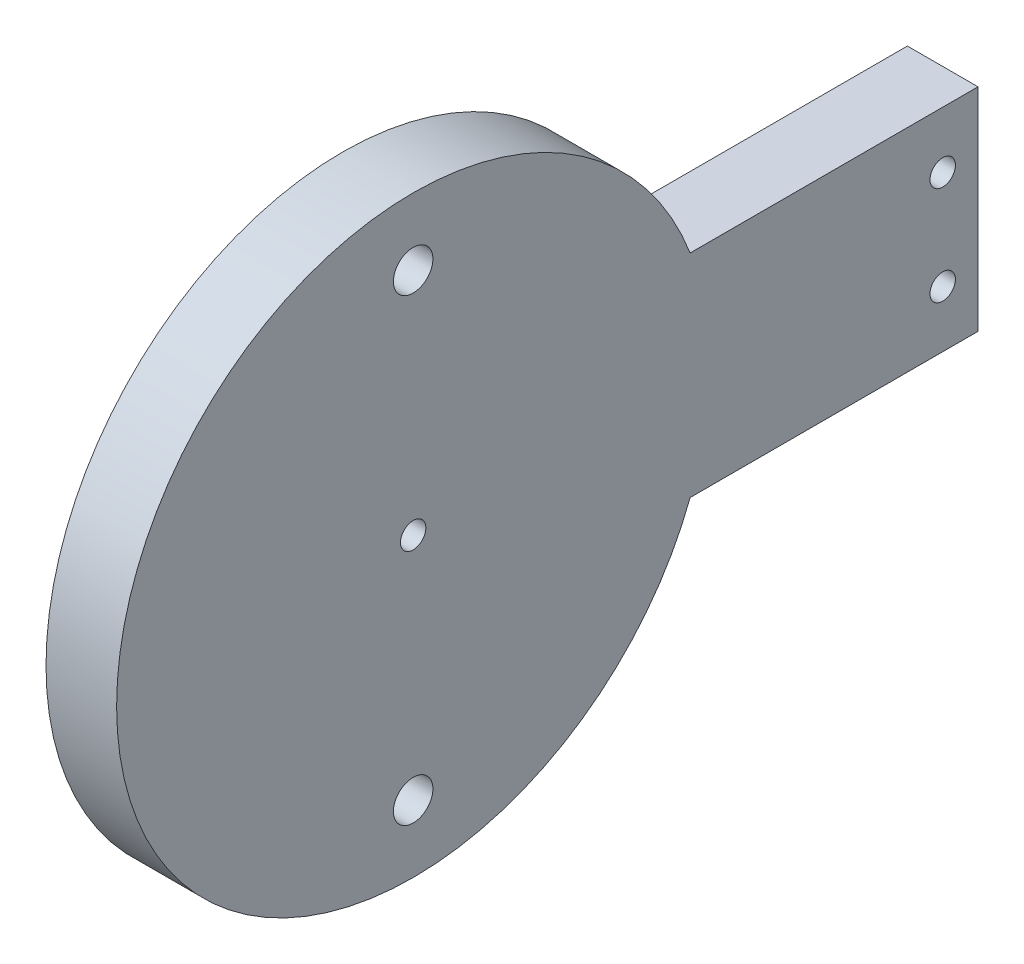
ISO-10303-21;
HEADER;
FILE_DESCRIPTION(('STEP AP214'),'2;1');
FILE_NAME('part.step','',(''),(''),'','','');
FILE_SCHEMA(('AUTOMOTIVE_DESIGN { 1 0 10303 214 1 1 1 1 }'));
ENDSEC;
DATA;
#1=APPLICATION_CONTEXT('core data for automotive mechanical design processes');
#2=APPLICATION_PROTOCOL_DEFINITION('international standard','automotive_design',2000,#1);
#3=PRODUCT_CONTEXT('',#1,'mechanical');
#4=PRODUCT('Part','Part','',(#3));
#5=PRODUCT_RELATED_PRODUCT_CATEGORY('part','',(#4));
#6=PRODUCT_DEFINITION_FORMATION('','',#4);
#7=PRODUCT_DEFINITION_CONTEXT('part definition',#1,'design');
#8=PRODUCT_DEFINITION('design','',#6,#7);
#9=PRODUCT_DEFINITION_SHAPE('','',#8);
#10=(LENGTH_UNIT() NAMED_UNIT(*) SI_UNIT(.MILLI.,.METRE.));
#11=(NAMED_UNIT(*) PLANE_ANGLE_UNIT() SI_UNIT($,.RADIAN.));
#12=(NAMED_UNIT(*) SI_UNIT($,.STERADIAN.) SOLID_ANGLE_UNIT());
#13=UNCERTAINTY_MEASURE_WITH_UNIT(LENGTH_MEASURE(1.E-05),#10,'distance_accuracy_value','');
#14=(GEOMETRIC_REPRESENTATION_CONTEXT(3) GLOBAL_UNCERTAINTY_ASSIGNED_CONTEXT((#13)) GLOBAL_UNIT_ASSIGNED_CONTEXT((#10,
#11,#12)) REPRESENTATION_CONTEXT('',''));
#15=CARTESIAN_POINT('',(0.,0.,0.));
#16=DIRECTION('',(0.,0.,1.));
#17=DIRECTION('',(1.,0.,0.));
#18=AXIS2_PLACEMENT_3D('',#15,#16,#17);
#19=CARTESIAN_POINT('',(-4.00000000000001,13.5,21.8771349286105));
#20=DIRECTION('',(-1.,0.,0.));
#21=DIRECTION('',(0.,0.,1.));
#22=AXIS2_PLACEMENT_3D('',#19,#20,#21);
#23=CYLINDRICAL_SURFACE('',#22,21.);
#24=CARTESIAN_POINT('',(-9.00000000000001,13.5,21.8771349286105));
#25=DIRECTION('',(-1.,0.,0.));
#26=DIRECTION('',(0.,0.,1.));
#27=AXIS2_PLACEMENT_3D('',#24,#25,#26);
#28=CIRCLE('',#27,21.);
#29=CARTESIAN_POINT('',(-9.00000000000001,5.99999999999999,2.26208968267751));
#30=VERTEX_POINT('',#29);
#31=CARTESIAN_POINT('',(-9.00000000000001,21.,2.26208968267751));
#32=VERTEX_POINT('',#31);
#33=EDGE_CURVE('E99',#30,#32,#28,.T.);
#34=ORIENTED_EDGE('',*,*,#33,.F.);
#35=DIRECTION('',(-1.,0.,0.));
#36=VECTOR('',#35,1.);
#37=CARTESIAN_POINT('',(-4.00000000000001,5.99999999999999,2.26208968267751));
#38=LINE('',#37,#36);
#39=CARTESIAN_POINT('',(-4.00000000000001,5.99999999999999,2.26208968267751));
#40=VERTEX_POINT('',#39);
#41=EDGE_CURVE('E11',#40,#30,#38,.T.);
#42=ORIENTED_EDGE('',*,*,#41,.F.);
#43=CARTESIAN_POINT('',(-4.00000000000001,13.5,21.8771349286105));
#44=DIRECTION('',(-1.,0.,0.));
#45=DIRECTION('',(0.,0.,1.));
#46=AXIS2_PLACEMENT_3D('',#43,#44,#45);
#47=CIRCLE('',#46,21.);
#48=CARTESIAN_POINT('',(-4.00000000000001,21.,2.26208968267751));
#49=VERTEX_POINT('',#48);
#50=EDGE_CURVE('E92',#40,#49,#47,.T.);
#51=ORIENTED_EDGE('',*,*,#50,.T.);
#52=DIRECTION('',(-1.,0.,0.));
#53=VECTOR('',#52,1.);
#54=CARTESIAN_POINT('',(-4.00000000000001,21.,2.26208968267751));
#55=LINE('',#54,#53);
#56=EDGE_CURVE('E37',#49,#32,#55,.T.);
#57=ORIENTED_EDGE('',*,*,#56,.T.);
#58=EDGE_LOOP('',(#34,#42,#51,#57));
#59=FACE_BOUND('',#58,.T.);
#60=ADVANCED_FACE('F34',(#59),#23,.T.);
#61=CARTESIAN_POINT('',(-4.00000000000001,5.99999999999999,-18.1228650713895));
#62=DIRECTION('',(0.,-1.,0.));
#63=DIRECTION('',(0.,0.,-1.));
#64=AXIS2_PLACEMENT_3D('',#61,#62,#63);
#65=PLANE('',#64);
#66=DIRECTION('',(0.,0.,1.));
#67=VECTOR('',#66,1.);
#68=CARTESIAN_POINT('',(-9.00000000000001,5.99999999999999,-18.1228650713895));
#69=LINE('',#68,#67);
#70=CARTESIAN_POINT('',(-9.00000000000001,5.99999999999999,-18.1228650713895));
#71=VERTEX_POINT('',#70);
#72=EDGE_CURVE('E94',#71,#30,#69,.T.);
#73=ORIENTED_EDGE('',*,*,#72,.F.);
#74=DIRECTION('',(-1.,0.,0.));
#75=VECTOR('',#74,1.);
#76=CARTESIAN_POINT('',(-4.00000000000001,5.99999999999999,-18.1228650713895));
#77=LINE('',#76,#75);
#78=CARTESIAN_POINT('',(-4.00000000000001,5.99999999999999,-18.1228650713895));
#79=VERTEX_POINT('',#78);
#80=EDGE_CURVE('E43',#79,#71,#77,.T.);
#81=ORIENTED_EDGE('',*,*,#80,.F.);
#82=DIRECTION('',(0.,0.,1.));
#83=VECTOR('',#82,1.);
#84=CARTESIAN_POINT('',(-4.00000000000001,5.99999999999999,-18.1228650713895));
#85=LINE('',#84,#83);
#86=EDGE_CURVE('E89',#79,#40,#85,.T.);
#87=ORIENTED_EDGE('',*,*,#86,.T.);
#88=ORIENTED_EDGE('',*,*,#41,.T.);
#89=EDGE_LOOP('',(#73,#81,#87,#88));
#90=FACE_BOUND('',#89,.T.);
#91=ADVANCED_FACE('F110',(#90),#65,.T.);
#92=CARTESIAN_POINT('',(-4.00000000000001,21.,-18.1228650713895));
#93=DIRECTION('',(0.,0.,-1.));
#94=DIRECTION('',(-1.,0.,0.));
#95=AXIS2_PLACEMENT_3D('',#92,#93,#94);
#96=PLANE('',#95);
#97=DIRECTION('',(0.,-1.,0.));
#98=VECTOR('',#97,1.);
#99=CARTESIAN_POINT('',(-9.00000000000001,21.,-18.1228650713895));
#100=LINE('',#99,#98);
#101=CARTESIAN_POINT('',(-9.00000000000001,21.,-18.1228650713895));
#102=VERTEX_POINT('',#101);
#103=EDGE_CURVE('E84',#102,#71,#100,.T.);
#104=ORIENTED_EDGE('',*,*,#103,.F.);
#105=DIRECTION('',(-1.,0.,0.));
#106=VECTOR('',#105,1.);
#107=CARTESIAN_POINT('',(-4.00000000000001,21.,-18.1228650713895));
#108=LINE('',#107,#106);
#109=CARTESIAN_POINT('',(-4.00000000000001,21.,-18.1228650713895));
#110=VERTEX_POINT('',#109);
#111=EDGE_CURVE('E79',#110,#102,#108,.T.);
#112=ORIENTED_EDGE('',*,*,#111,.F.);
#113=DIRECTION('',(0.,-1.,0.));
#114=VECTOR('',#113,1.);
#115=CARTESIAN_POINT('',(-4.00000000000001,21.,-18.1228650713895));
#116=LINE('',#115,#114);
#117=EDGE_CURVE('E82',#110,#79,#116,.T.);
#118=ORIENTED_EDGE('',*,*,#117,.T.);
#119=ORIENTED_EDGE('',*,*,#80,.T.);
#120=EDGE_LOOP('',(#104,#112,#118,#119));
#121=FACE_BOUND('',#120,.T.);
#122=ADVANCED_FACE('F81',(#121),#96,.T.);
#123=CARTESIAN_POINT('',(-4.00000000000001,21.,-18.1228650713895));
#124=DIRECTION('',(0.,1.,0.));
#125=DIRECTION('',(0.,0.,1.));
#126=AXIS2_PLACEMENT_3D('',#123,#124,#125);
#127=PLANE('',#126);
#128=DIRECTION('',(0.,0.,-1.));
#129=VECTOR('',#128,1.);
#130=CARTESIAN_POINT('',(-9.00000000000001,21.,-18.1228650713895));
#131=LINE('',#130,#129);
#132=EDGE_CURVE('E102',#32,#102,#131,.T.);
#133=ORIENTED_EDGE('',*,*,#132,.F.);
#134=ORIENTED_EDGE('',*,*,#56,.F.);
#135=DIRECTION('',(0.,0.,-1.));
#136=VECTOR('',#135,1.);
#137=CARTESIAN_POINT('',(-4.00000000000001,21.,-18.1228650713895));
#138=LINE('',#137,#136);
#139=EDGE_CURVE('E88',#49,#110,#138,.T.);
#140=ORIENTED_EDGE('',*,*,#139,.T.);
#141=ORIENTED_EDGE('',*,*,#111,.T.);
#142=EDGE_LOOP('',(#133,#134,#140,#141));
#143=FACE_BOUND('',#142,.T.);
#144=ADVANCED_FACE('F91',(#143),#127,.T.);
#145=CARTESIAN_POINT('',(-4.00000000000001,13.5,21.8771349286105));
#146=DIRECTION('',(-1.,0.,0.));
#147=DIRECTION('',(0.,0.,1.));
#148=AXIS2_PLACEMENT_3D('',#145,#146,#147);
#149=PLANE('',#148);
#150=CARTESIAN_POINT('',(-4.00000000000001,17.,-15.6228650713895));
#151=DIRECTION('',(-1.,0.,0.));
#152=DIRECTION('',(0.,0.,1.));
#153=AXIS2_PLACEMENT_3D('',#150,#151,#152);
#154=CIRCLE('',#153,0.900000000000004);
#155=CARTESIAN_POINT('',(-4.00000000000001,17.,-14.7228650713894));
#156=VERTEX_POINT('',#155);
#157=EDGE_CURVE('E158',#156,#156,#154,.T.);
#158=ORIENTED_EDGE('',*,*,#157,.T.);
#159=EDGE_LOOP('',(#158));
#160=FACE_BOUND('',#159,.T.);
#161=CARTESIAN_POINT('',(-4.00000000000001,9.99999999999999,-15.6228650713895));
#162=DIRECTION('',(-1.,0.,0.));
#163=DIRECTION('',(0.,0.,1.));
#164=AXIS2_PLACEMENT_3D('',#161,#162,#163);
#165=CIRCLE('',#164,0.9);
#166=CARTESIAN_POINT('',(-4.00000000000001,9.99999999999999,-14.7228650713895));
#167=VERTEX_POINT('',#166);
#168=EDGE_CURVE('E160',#167,#167,#165,.T.);
#169=ORIENTED_EDGE('',*,*,#168,.T.);
#170=EDGE_LOOP('',(#169));
#171=FACE_BOUND('',#170,.T.);
#172=CARTESIAN_POINT('',(-4.00000000000001,29.75,21.8771349286105));
#173=DIRECTION('',(-1.,0.,0.));
#174=DIRECTION('',(0.,0.,1.));
#175=AXIS2_PLACEMENT_3D('',#172,#173,#174);
#176=CIRCLE('',#175,1.4);
#177=CARTESIAN_POINT('',(-4.00000000000001,29.75,23.2771349286105));
#178=VERTEX_POINT('',#177);
#179=EDGE_CURVE('E165',#178,#178,#176,.T.);
#180=ORIENTED_EDGE('',*,*,#179,.T.);
#181=EDGE_LOOP('',(#180));
#182=FACE_BOUND('',#181,.T.);
#183=CARTESIAN_POINT('',(-4.00000000000001,-2.75000000000001,21.8771349286105));
#184=DIRECTION('',(-1.,0.,0.));
#185=DIRECTION('',(0.,0.,1.));
#186=AXIS2_PLACEMENT_3D('',#183,#184,#185);
#187=CIRCLE('',#186,1.4);
#188=CARTESIAN_POINT('',(-4.00000000000001,-2.75000000000001,23.2771349286105));
#189=VERTEX_POINT('',#188);
#190=EDGE_CURVE('E174',#189,#189,#187,.T.);
#191=ORIENTED_EDGE('',*,*,#190,.T.);
#192=EDGE_LOOP('',(#191));
#193=FACE_BOUND('',#192,.T.);
#194=CARTESIAN_POINT('',(-4.00000000000001,13.5,21.8771349286105));
#195=DIRECTION('',(-1.,0.,0.));
#196=DIRECTION('',(0.,0.,1.));
#197=AXIS2_PLACEMENT_3D('',#194,#195,#196);
#198=CIRCLE('',#197,0.9);
#199=CARTESIAN_POINT('',(-4.00000000000001,13.5,22.7771349286106));
#200=VERTEX_POINT('',#199);
#201=EDGE_CURVE('E103',#200,#200,#198,.T.);
#202=ORIENTED_EDGE('',*,*,#201,.T.);
#203=EDGE_LOOP('',(#202));
#204=FACE_BOUND('',#203,.T.);
#205=ORIENTED_EDGE('',*,*,#50,.F.);
#206=ORIENTED_EDGE('',*,*,#86,.F.);
#207=ORIENTED_EDGE('',*,*,#117,.F.);
#208=ORIENTED_EDGE('',*,*,#139,.F.);
#209=EDGE_LOOP('',(#205,#206,#207,#208));
#210=FACE_BOUND('',#209,.T.);
#211=ADVANCED_FACE('F87',(#160,#171,#182,#193,#204,#210),#149,.F.);
#212=CARTESIAN_POINT('',(-9.00000000000001,13.5,21.8771349286105));
#213=DIRECTION('',(-1.,0.,0.));
#214=DIRECTION('',(0.,0.,1.));
#215=AXIS2_PLACEMENT_3D('',#212,#213,#214);
#216=PLANE('',#215);
#217=CARTESIAN_POINT('',(-9.00000000000001,17.,-15.6228650713895));
#218=DIRECTION('',(-1.,0.,0.));
#219=DIRECTION('',(0.,0.,1.));
#220=AXIS2_PLACEMENT_3D('',#217,#218,#219);
#221=CIRCLE('',#220,0.900000000000004);
#222=CARTESIAN_POINT('',(-9.00000000000001,17.,-14.7228650713894));
#223=VERTEX_POINT('',#222);
#224=EDGE_CURVE('E156',#223,#223,#221,.T.);
#225=ORIENTED_EDGE('',*,*,#224,.F.);
#226=EDGE_LOOP('',(#225));
#227=FACE_BOUND('',#226,.T.);
#228=CARTESIAN_POINT('',(-9.00000000000001,9.99999999999999,-15.6228650713895));
#229=DIRECTION('',(-1.,0.,0.));
#230=DIRECTION('',(0.,0.,1.));
#231=AXIS2_PLACEMENT_3D('',#228,#229,#230);
#232=CIRCLE('',#231,0.9);
#233=CARTESIAN_POINT('',(-9.00000000000001,9.99999999999999,-14.7228650713895));
#234=VERTEX_POINT('',#233);
#235=EDGE_CURVE('E183',#234,#234,#232,.T.);
#236=ORIENTED_EDGE('',*,*,#235,.F.);
#237=EDGE_LOOP('',(#236));
#238=FACE_BOUND('',#237,.T.);
#239=CARTESIAN_POINT('',(-9.00000000000001,29.75,21.8771349286105));
#240=DIRECTION('',(-1.,0.,0.));
#241=DIRECTION('',(0.,0.,1.));
#242=AXIS2_PLACEMENT_3D('',#239,#240,#241);
#243=CIRCLE('',#242,1.4);
#244=CARTESIAN_POINT('',(-9.00000000000001,29.75,23.2771349286105));
#245=VERTEX_POINT('',#244);
#246=EDGE_CURVE('E180',#245,#245,#243,.T.);
#247=ORIENTED_EDGE('',*,*,#246,.F.);
#248=EDGE_LOOP('',(#247));
#249=FACE_BOUND('',#248,.T.);
#250=CARTESIAN_POINT('',(-9.00000000000001,-2.75000000000001,21.8771349286105));
#251=DIRECTION('',(-1.,0.,0.));
#252=DIRECTION('',(0.,0.,1.));
#253=AXIS2_PLACEMENT_3D('',#250,#251,#252);
#254=CIRCLE('',#253,1.4);
#255=CARTESIAN_POINT('',(-9.00000000000001,-2.75000000000001,23.2771349286105));
#256=VERTEX_POINT('',#255);
#257=EDGE_CURVE('E177',#256,#256,#254,.T.);
#258=ORIENTED_EDGE('',*,*,#257,.F.);
#259=EDGE_LOOP('',(#258));
#260=FACE_BOUND('',#259,.T.);
#261=CARTESIAN_POINT('',(-9.00000000000001,13.5,21.8771349286105));
#262=DIRECTION('',(-1.,0.,0.));
#263=DIRECTION('',(0.,0.,1.));
#264=AXIS2_PLACEMENT_3D('',#261,#262,#263);
#265=CIRCLE('',#264,0.9);
#266=CARTESIAN_POINT('',(-9.00000000000001,13.5,22.7771349286106));
#267=VERTEX_POINT('',#266);
#268=EDGE_CURVE('E159',#267,#267,#265,.T.);
#269=ORIENTED_EDGE('',*,*,#268,.F.);
#270=EDGE_LOOP('',(#269));
#271=FACE_BOUND('',#270,.T.);
#272=ORIENTED_EDGE('',*,*,#33,.T.);
#273=ORIENTED_EDGE('',*,*,#132,.T.);
#274=ORIENTED_EDGE('',*,*,#103,.T.);
#275=ORIENTED_EDGE('',*,*,#72,.T.);
#276=EDGE_LOOP('',(#272,#273,#274,#275));
#277=FACE_BOUND('',#276,.T.);
#278=ADVANCED_FACE('F109',(#227,#238,#249,#260,#271,#277),#216,.T.);
#279=CARTESIAN_POINT('',(0.999999999999992,13.5,21.8771349286105));
#280=DIRECTION('',(-1.,0.,0.));
#281=DIRECTION('',(0.,0.,1.));
#282=AXIS2_PLACEMENT_3D('',#279,#280,#281);
#283=CYLINDRICAL_SURFACE('',#282,0.9);
#284=ORIENTED_EDGE('',*,*,#268,.T.);
#285=EDGE_LOOP('',(#284));
#286=FACE_BOUND('',#285,.T.);
#287=ORIENTED_EDGE('',*,*,#201,.F.);
#288=EDGE_LOOP('',(#287));
#289=FACE_BOUND('',#288,.T.);
#290=ADVANCED_FACE('F128',(#286,#289),#283,.F.);
#291=CARTESIAN_POINT('',(0.999999999999992,-2.75000000000001,21.8771349286105));
#292=DIRECTION('',(-1.,0.,0.));
#293=DIRECTION('',(0.,0.,1.));
#294=AXIS2_PLACEMENT_3D('',#291,#292,#293);
#295=CYLINDRICAL_SURFACE('',#294,1.4);
#296=ORIENTED_EDGE('',*,*,#257,.T.);
#297=EDGE_LOOP('',(#296));
#298=FACE_BOUND('',#297,.T.);
#299=ORIENTED_EDGE('',*,*,#190,.F.);
#300=EDGE_LOOP('',(#299));
#301=FACE_BOUND('',#300,.T.);
#302=ADVANCED_FACE('F135',(#298,#301),#295,.F.);
#303=CARTESIAN_POINT('',(0.999999999999992,29.75,21.8771349286105));
#304=DIRECTION('',(-1.,0.,0.));
#305=DIRECTION('',(0.,0.,1.));
#306=AXIS2_PLACEMENT_3D('',#303,#304,#305);
#307=CYLINDRICAL_SURFACE('',#306,1.4);
#308=ORIENTED_EDGE('',*,*,#246,.T.);
#309=EDGE_LOOP('',(#308));
#310=FACE_BOUND('',#309,.T.);
#311=ORIENTED_EDGE('',*,*,#179,.F.);
#312=EDGE_LOOP('',(#311));
#313=FACE_BOUND('',#312,.T.);
#314=ADVANCED_FACE('F139',(#310,#313),#307,.F.);
#315=CARTESIAN_POINT('',(0.999999999999992,9.99999999999999,-15.6228650713895));
#316=DIRECTION('',(-1.,0.,0.));
#317=DIRECTION('',(0.,0.,1.));
#318=AXIS2_PLACEMENT_3D('',#315,#316,#317);
#319=CYLINDRICAL_SURFACE('',#318,0.9);
#320=ORIENTED_EDGE('',*,*,#235,.T.);
#321=EDGE_LOOP('',(#320));
#322=FACE_BOUND('',#321,.T.);
#323=ORIENTED_EDGE('',*,*,#168,.F.);
#324=EDGE_LOOP('',(#323));
#325=FACE_BOUND('',#324,.T.);
#326=ADVANCED_FACE('F143',(#322,#325),#319,.F.);
#327=CARTESIAN_POINT('',(0.999999999999992,17.,-15.6228650713895));
#328=DIRECTION('',(-1.,0.,0.));
#329=DIRECTION('',(0.,0.,1.));
#330=AXIS2_PLACEMENT_3D('',#327,#328,#329);
#331=CYLINDRICAL_SURFACE('',#330,0.900000000000004);
#332=ORIENTED_EDGE('',*,*,#224,.T.);
#333=EDGE_LOOP('',(#332));
#334=FACE_BOUND('',#333,.T.);
#335=ORIENTED_EDGE('',*,*,#157,.F.);
#336=EDGE_LOOP('',(#335));
#337=FACE_BOUND('',#336,.T.);
#338=ADVANCED_FACE('F147',(#334,#337),#331,.F.);
#339=CLOSED_SHELL('',(#60,#91,#122,#144,#211,#278,#290,#302,#314,#326,#338));
#340=MANIFOLD_SOLID_BREP('B2',#339);
#341=ADVANCED_BREP_SHAPE_REPRESENTATION('',(#18,#340),#14);
#342=SHAPE_DEFINITION_REPRESENTATION(#9,#341);
ENDSEC;
END-ISO-10303-21;
